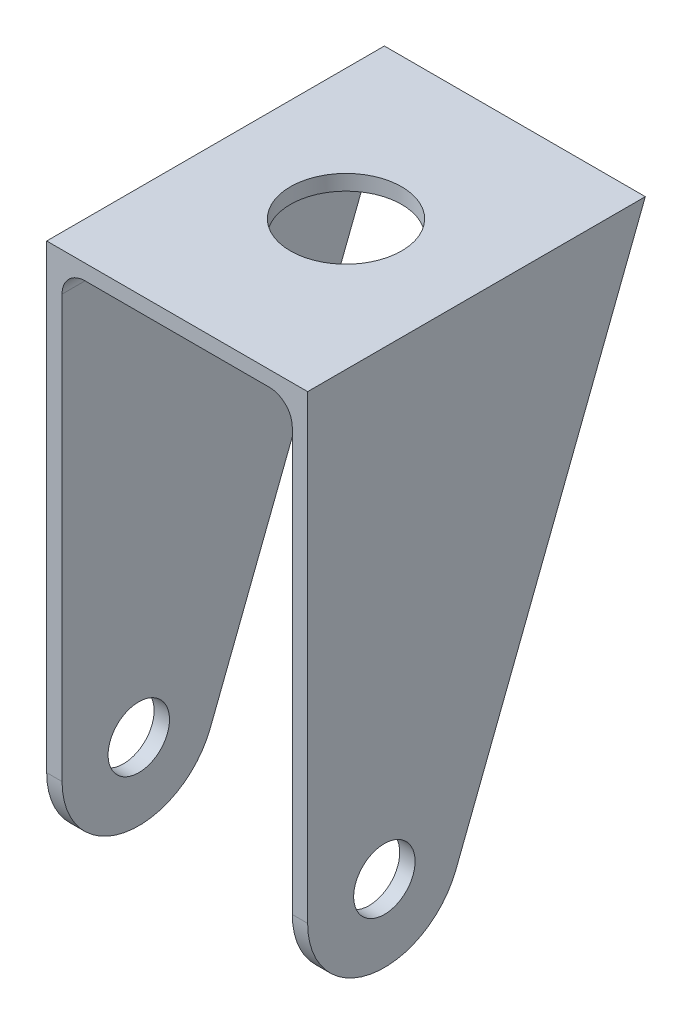
ISO-10303-21;
HEADER;
FILE_DESCRIPTION(('STEP AP214'),'2;1');
FILE_NAME('part.step','',(''),(''),'','','');
FILE_SCHEMA(('AUTOMOTIVE_DESIGN { 1 0 10303 214 1 1 1 1 }'));
ENDSEC;
DATA;
#1=APPLICATION_CONTEXT('core data for automotive mechanical design processes');
#2=APPLICATION_PROTOCOL_DEFINITION('international standard','automotive_design',2000,#1);
#3=PRODUCT_CONTEXT('',#1,'mechanical');
#4=PRODUCT('Part','Part','',(#3));
#5=PRODUCT_RELATED_PRODUCT_CATEGORY('part','',(#4));
#6=PRODUCT_DEFINITION_FORMATION('','',#4);
#7=PRODUCT_DEFINITION_CONTEXT('part definition',#1,'design');
#8=PRODUCT_DEFINITION('design','',#6,#7);
#9=PRODUCT_DEFINITION_SHAPE('','',#8);
#10=(LENGTH_UNIT() NAMED_UNIT(*) SI_UNIT(.MILLI.,.METRE.));
#11=(NAMED_UNIT(*) PLANE_ANGLE_UNIT() SI_UNIT($,.RADIAN.));
#12=(NAMED_UNIT(*) SI_UNIT($,.STERADIAN.) SOLID_ANGLE_UNIT());
#13=UNCERTAINTY_MEASURE_WITH_UNIT(LENGTH_MEASURE(1.E-05),#10,'distance_accuracy_value','');
#14=(GEOMETRIC_REPRESENTATION_CONTEXT(3) GLOBAL_UNCERTAINTY_ASSIGNED_CONTEXT((#13)) GLOBAL_UNIT_ASSIGNED_CONTEXT((#10,
#11,#12)) REPRESENTATION_CONTEXT('',''));
#15=CARTESIAN_POINT('',(0.,0.,0.));
#16=DIRECTION('',(0.,0.,1.));
#17=DIRECTION('',(1.,0.,0.));
#18=AXIS2_PLACEMENT_3D('',#15,#16,#17);
#19=CARTESIAN_POINT('',(-17.,0.,0.));
#20=DIRECTION('',(1.,0.,0.));
#21=DIRECTION('',(0.,0.,-1.));
#22=AXIS2_PLACEMENT_3D('',#19,#20,#21);
#23=CYLINDRICAL_SURFACE('',#22,9.99999999999999);
#24=DIRECTION('',(1.,0.,0.));
#25=VECTOR('',#24,1.);
#26=CARTESIAN_POINT('',(-17.,-3.61645543914119,-9.32315665730797));
#27=LINE('',#26,#25);
#28=CARTESIAN_POINT('',(-17.,-3.61645543914119,-9.32315665730797));
#29=VERTEX_POINT('',#28);
#30=CARTESIAN_POINT('',(-15.,-3.61645543914119,-9.32315665730797));
#31=VERTEX_POINT('',#30);
#32=EDGE_CURVE('E36',#29,#31,#27,.T.);
#33=ORIENTED_EDGE('',*,*,#32,.T.);
#34=CARTESIAN_POINT('',(-15.,0.,0.));
#35=DIRECTION('',(1.,0.,0.));
#36=DIRECTION('',(0.,0.,-1.));
#37=AXIS2_PLACEMENT_3D('',#34,#35,#36);
#38=CIRCLE('',#37,9.99999999999999);
#39=CARTESIAN_POINT('',(-15.,0.,10.));
#40=VERTEX_POINT('',#39);
#41=EDGE_CURVE('E117',#40,#31,#38,.T.);
#42=ORIENTED_EDGE('',*,*,#41,.F.);
#43=DIRECTION('',(1.,0.,0.));
#44=VECTOR('',#43,1.);
#45=CARTESIAN_POINT('',(-17.,0.,10.));
#46=LINE('',#45,#44);
#47=CARTESIAN_POINT('',(-17.,0.,10.));
#48=VERTEX_POINT('',#47);
#49=EDGE_CURVE('E11',#48,#40,#46,.T.);
#50=ORIENTED_EDGE('',*,*,#49,.F.);
#51=CARTESIAN_POINT('',(-17.,0.,0.));
#52=DIRECTION('',(1.,0.,0.));
#53=DIRECTION('',(0.,0.,-1.));
#54=AXIS2_PLACEMENT_3D('',#51,#52,#53);
#55=CIRCLE('',#54,9.99999999999999);
#56=EDGE_CURVE('E132',#48,#29,#55,.T.);
#57=ORIENTED_EDGE('',*,*,#56,.T.);
#58=EDGE_LOOP('',(#33,#42,#50,#57));
#59=FACE_BOUND('',#58,.T.);
#60=ADVANCED_FACE('F33',(#59),#23,.T.);
#61=CARTESIAN_POINT('',(15.,0.,10.));
#62=VERTEX_POINT('',#61);
#63=CARTESIAN_POINT('',(17.,0.,10.));
#64=VERTEX_POINT('',#63);
#65=EDGE_CURVE('E41',#62,#64,#46,.T.);
#66=ORIENTED_EDGE('',*,*,#65,.F.);
#67=CARTESIAN_POINT('',(15.,0.,0.));
#68=DIRECTION('',(-1.,0.,0.));
#69=DIRECTION('',(0.,-1.,0.));
#70=AXIS2_PLACEMENT_3D('',#67,#68,#69);
#71=CIRCLE('',#70,9.99999999999999);
#72=CARTESIAN_POINT('',(15.,-3.61645543914119,-9.32315665730797));
#73=VERTEX_POINT('',#72);
#74=EDGE_CURVE('E123',#73,#62,#71,.T.);
#75=ORIENTED_EDGE('',*,*,#74,.F.);
#76=CARTESIAN_POINT('',(17.,-3.61645543914119,-9.32315665730797));
#77=VERTEX_POINT('',#76);
#78=EDGE_CURVE('E134',#73,#77,#27,.T.);
#79=ORIENTED_EDGE('',*,*,#78,.T.);
#80=CARTESIAN_POINT('',(17.,0.,0.));
#81=DIRECTION('',(1.,0.,0.));
#82=DIRECTION('',(0.,0.,-1.));
#83=AXIS2_PLACEMENT_3D('',#80,#81,#82);
#84=CIRCLE('',#83,9.99999999999999);
#85=EDGE_CURVE('E150',#64,#77,#84,.T.);
#86=ORIENTED_EDGE('',*,*,#85,.F.);
#87=EDGE_LOOP('',(#66,#75,#79,#86));
#88=FACE_BOUND('',#87,.T.);
#89=ADVANCED_FACE('F171',(#88),#23,.T.);
#90=CARTESIAN_POINT('',(-17.,0.,10.));
#91=DIRECTION('',(0.,0.,1.));
#92=DIRECTION('',(1.,0.,0.));
#93=AXIS2_PLACEMENT_3D('',#90,#91,#92);
#94=PLANE('',#93);
#95=ORIENTED_EDGE('',*,*,#49,.T.);
#96=DIRECTION('',(0.,-1.,0.));
#97=VECTOR('',#96,1.);
#98=CARTESIAN_POINT('',(-15.,-9.99999999999999,10.));
#99=LINE('',#98,#97);
#100=CARTESIAN_POINT('',(-15.,55.,10.));
#101=VERTEX_POINT('',#100);
#102=EDGE_CURVE('E121',#101,#40,#99,.T.);
#103=ORIENTED_EDGE('',*,*,#102,.F.);
#104=CARTESIAN_POINT('',(-12.,55.,10.));
#105=DIRECTION('',(0.,0.,1.));
#106=DIRECTION('',(1.,0.,0.));
#107=AXIS2_PLACEMENT_3D('',#104,#105,#106);
#108=CIRCLE('',#107,3.);
#109=CARTESIAN_POINT('',(-12.,58.,10.));
#110=VERTEX_POINT('',#109);
#111=EDGE_CURVE('E300',#110,#101,#108,.T.);
#112=ORIENTED_EDGE('',*,*,#111,.F.);
#113=DIRECTION('',(-1.,0.,0.));
#114=VECTOR('',#113,1.);
#115=CARTESIAN_POINT('',(-12.,58.,10.));
#116=LINE('',#115,#114);
#117=CARTESIAN_POINT('',(12.,58.,10.));
#118=VERTEX_POINT('',#117);
#119=EDGE_CURVE('E122',#118,#110,#116,.T.);
#120=ORIENTED_EDGE('',*,*,#119,.F.);
#121=CARTESIAN_POINT('',(12.,55.,10.));
#122=DIRECTION('',(0.,0.,1.));
#123=DIRECTION('',(1.,0.,0.));
#124=AXIS2_PLACEMENT_3D('',#121,#122,#123);
#125=CIRCLE('',#124,3.);
#126=CARTESIAN_POINT('',(15.,55.,10.));
#127=VERTEX_POINT('',#126);
#128=EDGE_CURVE('E321',#127,#118,#125,.T.);
#129=ORIENTED_EDGE('',*,*,#128,.F.);
#130=DIRECTION('',(0.,1.,0.));
#131=VECTOR('',#130,1.);
#132=CARTESIAN_POINT('',(15.,55.,10.));
#133=LINE('',#132,#131);
#134=EDGE_CURVE('E324',#62,#127,#133,.T.);
#135=ORIENTED_EDGE('',*,*,#134,.F.);
#136=ORIENTED_EDGE('',*,*,#65,.T.);
#137=DIRECTION('',(0.,-1.,0.));
#138=VECTOR('',#137,1.);
#139=CARTESIAN_POINT('',(17.,0.,10.));
#140=LINE('',#139,#138);
#141=CARTESIAN_POINT('',(17.,60.,10.));
#142=VERTEX_POINT('',#141);
#143=EDGE_CURVE('E160',#142,#64,#140,.T.);
#144=ORIENTED_EDGE('',*,*,#143,.F.);
#145=DIRECTION('',(1.,0.,0.));
#146=VECTOR('',#145,1.);
#147=CARTESIAN_POINT('',(-17.,60.,10.));
#148=LINE('',#147,#146);
#149=CARTESIAN_POINT('',(-17.,60.,10.));
#150=VERTEX_POINT('',#149);
#151=EDGE_CURVE('E135',#150,#142,#148,.T.);
#152=ORIENTED_EDGE('',*,*,#151,.F.);
#153=DIRECTION('',(0.,-1.,0.));
#154=VECTOR('',#153,1.);
#155=CARTESIAN_POINT('',(-17.,0.,10.));
#156=LINE('',#155,#154);
#157=EDGE_CURVE('E136',#150,#48,#156,.T.);
#158=ORIENTED_EDGE('',*,*,#157,.T.);
#159=EDGE_LOOP('',(#95,#103,#112,#120,#129,#135,#136,#144,#152,#158));
#160=FACE_BOUND('',#159,.T.);
#161=ADVANCED_FACE('F169',(#160),#94,.T.);
#162=CARTESIAN_POINT('',(-17.,60.,-34.));
#163=DIRECTION('',(0.,-0.361645543914119,-0.932315665730798));
#164=DIRECTION('',(0.,0.932315665730798,-0.361645543914119));
#165=AXIS2_PLACEMENT_3D('',#162,#163,#164);
#166=PLANE('',#165);
#167=CARTESIAN_POINT('',(-12.,55.,-32.0604984062418));
#168=DIRECTION('',(0.,-0.361645543914119,-0.932315665730798));
#169=DIRECTION('',(0.,-0.932315665730798,0.361645543914119));
#170=AXIS2_PLACEMENT_3D('',#167,#168,#169);
#171=ELLIPSE('',#170,3.21779426247058,3.);
#172=CARTESIAN_POINT('',(-12.,58.,-33.2241993624967));
#173=VERTEX_POINT('',#172);
#174=CARTESIAN_POINT('',(-15.,55.,-32.0604984062418));
#175=VERTEX_POINT('',#174);
#176=EDGE_CURVE('E129',#173,#175,#171,.F.);
#177=ORIENTED_EDGE('',*,*,#176,.T.);
#178=DIRECTION('',(0.,-0.932315665730798,0.361645543914119));
#179=VECTOR('',#178,1.);
#180=CARTESIAN_POINT('',(-15.,-0.844537871888236,-10.3983843651986));
#181=LINE('',#180,#179);
#182=EDGE_CURVE('E49',#175,#31,#181,.T.);
#183=ORIENTED_EDGE('',*,*,#182,.T.);
#184=ORIENTED_EDGE('',*,*,#32,.F.);
#185=DIRECTION('',(0.,0.932315665730798,-0.361645543914119));
#186=VECTOR('',#185,1.);
#187=CARTESIAN_POINT('',(-17.,60.,-34.));
#188=LINE('',#187,#186);
#189=CARTESIAN_POINT('',(-17.,60.,-34.));
#190=VERTEX_POINT('',#189);
#191=EDGE_CURVE('E146',#29,#190,#188,.T.);
#192=ORIENTED_EDGE('',*,*,#191,.T.);
#193=DIRECTION('',(1.,0.,0.));
#194=VECTOR('',#193,1.);
#195=CARTESIAN_POINT('',(-17.,60.,-34.));
#196=LINE('',#195,#194);
#197=CARTESIAN_POINT('',(17.,60.,-34.));
#198=VERTEX_POINT('',#197);
#199=EDGE_CURVE('E133',#190,#198,#196,.T.);
#200=ORIENTED_EDGE('',*,*,#199,.T.);
#201=DIRECTION('',(0.,0.932315665730798,-0.361645543914119));
#202=VECTOR('',#201,1.);
#203=CARTESIAN_POINT('',(17.,60.,-34.));
#204=LINE('',#203,#202);
#205=EDGE_CURVE('E153',#77,#198,#204,.T.);
#206=ORIENTED_EDGE('',*,*,#205,.F.);
#207=ORIENTED_EDGE('',*,*,#78,.F.);
#208=DIRECTION('',(0.,0.932315665730798,-0.361645543914119));
#209=VECTOR('',#208,1.);
#210=CARTESIAN_POINT('',(15.,55.6542746649707,-32.3142917573351));
#211=LINE('',#210,#209);
#212=CARTESIAN_POINT('',(15.,55.,-32.0604984062418));
#213=VERTEX_POINT('',#212);
#214=EDGE_CURVE('E130',#73,#213,#211,.T.);
#215=ORIENTED_EDGE('',*,*,#214,.T.);
#216=CARTESIAN_POINT('',(12.,55.,-32.0604984062418));
#217=DIRECTION('',(0.,-0.361645543914119,-0.932315665730798));
#218=DIRECTION('',(0.,-0.932315665730798,0.361645543914119));
#219=AXIS2_PLACEMENT_3D('',#216,#217,#218);
#220=ELLIPSE('',#219,3.21779426247058,3.);
#221=CARTESIAN_POINT('',(12.,58.,-33.2241993624967));
#222=VERTEX_POINT('',#221);
#223=EDGE_CURVE('E336',#213,#222,#220,.F.);
#224=ORIENTED_EDGE('',*,*,#223,.T.);
#225=DIRECTION('',(-1.,0.,0.));
#226=VECTOR('',#225,1.);
#227=CARTESIAN_POINT('',(-12.,58.,-33.2241993624967));
#228=LINE('',#227,#226);
#229=EDGE_CURVE('E338',#222,#173,#228,.T.);
#230=ORIENTED_EDGE('',*,*,#229,.T.);
#231=EDGE_LOOP('',(#177,#183,#184,#192,#200,#206,#207,#215,#224,#230));
#232=FACE_BOUND('',#231,.T.);
#233=ADVANCED_FACE('F126',(#232),#166,.T.);
#234=CARTESIAN_POINT('',(-17.,0.,0.));
#235=DIRECTION('',(1.,0.,0.));
#236=DIRECTION('',(0.,0.,-1.));
#237=AXIS2_PLACEMENT_3D('',#234,#235,#236);
#238=CYLINDRICAL_SURFACE('',#237,4.);
#239=CARTESIAN_POINT('',(-17.,0.,0.));
#240=DIRECTION('',(1.,0.,0.));
#241=DIRECTION('',(0.,0.,-1.));
#242=AXIS2_PLACEMENT_3D('',#239,#240,#241);
#243=CIRCLE('',#242,4.);
#244=CARTESIAN_POINT('',(-17.,0.,-4.));
#245=VERTEX_POINT('',#244);
#246=EDGE_CURVE('E154',#245,#245,#243,.T.);
#247=ORIENTED_EDGE('',*,*,#246,.F.);
#248=EDGE_LOOP('',(#247));
#249=FACE_BOUND('',#248,.T.);
#250=CARTESIAN_POINT('',(-15.,0.,0.));
#251=DIRECTION('',(1.,0.,0.));
#252=DIRECTION('',(0.,0.,-1.));
#253=AXIS2_PLACEMENT_3D('',#250,#251,#252);
#254=CIRCLE('',#253,4.);
#255=CARTESIAN_POINT('',(-15.,0.,-4.));
#256=VERTEX_POINT('',#255);
#257=EDGE_CURVE('E312',#256,#256,#254,.T.);
#258=ORIENTED_EDGE('',*,*,#257,.T.);
#259=EDGE_LOOP('',(#258));
#260=FACE_BOUND('',#259,.T.);
#261=ADVANCED_FACE('F177',(#249,#260),#238,.F.);
#262=CARTESIAN_POINT('',(17.,0.,0.));
#263=DIRECTION('',(1.,0.,0.));
#264=DIRECTION('',(0.,0.,-1.));
#265=AXIS2_PLACEMENT_3D('',#262,#263,#264);
#266=CIRCLE('',#265,4.);
#267=CARTESIAN_POINT('',(17.,0.,-4.));
#268=VERTEX_POINT('',#267);
#269=EDGE_CURVE('E299',#268,#268,#266,.T.);
#270=ORIENTED_EDGE('',*,*,#269,.T.);
#271=EDGE_LOOP('',(#270));
#272=FACE_BOUND('',#271,.T.);
#273=CARTESIAN_POINT('',(15.,0.,0.));
#274=DIRECTION('',(-1.,0.,0.));
#275=DIRECTION('',(0.,-1.,0.));
#276=AXIS2_PLACEMENT_3D('',#273,#274,#275);
#277=CIRCLE('',#276,4.);
#278=CARTESIAN_POINT('',(15.,-4.,0.));
#279=VERTEX_POINT('',#278);
#280=EDGE_CURVE('E315',#279,#279,#277,.T.);
#281=ORIENTED_EDGE('',*,*,#280,.T.);
#282=EDGE_LOOP('',(#281));
#283=FACE_BOUND('',#282,.T.);
#284=ADVANCED_FACE('F207',(#272,#283),#238,.F.);
#285=CARTESIAN_POINT('',(-17.,60.,10.));
#286=DIRECTION('',(0.,1.,0.));
#287=DIRECTION('',(0.,0.,1.));
#288=AXIS2_PLACEMENT_3D('',#285,#286,#287);
#289=PLANE('',#288);
#290=CARTESIAN_POINT('',(0.,60.,-12.));
#291=DIRECTION('',(0.,1.,0.));
#292=DIRECTION('',(0.,0.,1.));
#293=AXIS2_PLACEMENT_3D('',#290,#291,#292);
#294=CIRCLE('',#293,7.25);
#295=CARTESIAN_POINT('',(0.,60.,-4.75));
#296=VERTEX_POINT('',#295);
#297=EDGE_CURVE('E339',#296,#296,#294,.T.);
#298=ORIENTED_EDGE('',*,*,#297,.F.);
#299=EDGE_LOOP('',(#298));
#300=FACE_BOUND('',#299,.T.);
#301=DIRECTION('',(0.,0.,1.));
#302=VECTOR('',#301,1.);
#303=CARTESIAN_POINT('',(17.,60.,10.));
#304=LINE('',#303,#302);
#305=EDGE_CURVE('E157',#198,#142,#304,.T.);
#306=ORIENTED_EDGE('',*,*,#305,.F.);
#307=ORIENTED_EDGE('',*,*,#199,.F.);
#308=DIRECTION('',(0.,0.,1.));
#309=VECTOR('',#308,1.);
#310=CARTESIAN_POINT('',(-17.,60.,10.));
#311=LINE('',#310,#309);
#312=EDGE_CURVE('E142',#190,#150,#311,.T.);
#313=ORIENTED_EDGE('',*,*,#312,.T.);
#314=ORIENTED_EDGE('',*,*,#151,.T.);
#315=EDGE_LOOP('',(#306,#307,#313,#314));
#316=FACE_BOUND('',#315,.T.);
#317=ADVANCED_FACE('F165',(#300,#316),#289,.T.);
#318=CARTESIAN_POINT('',(-17.,0.,0.));
#319=DIRECTION('',(1.,0.,0.));
#320=DIRECTION('',(0.,0.,-1.));
#321=AXIS2_PLACEMENT_3D('',#318,#319,#320);
#322=PLANE('',#321);
#323=ORIENTED_EDGE('',*,*,#246,.T.);
#324=EDGE_LOOP('',(#323));
#325=FACE_BOUND('',#324,.T.);
#326=ORIENTED_EDGE('',*,*,#56,.F.);
#327=ORIENTED_EDGE('',*,*,#157,.F.);
#328=ORIENTED_EDGE('',*,*,#312,.F.);
#329=ORIENTED_EDGE('',*,*,#191,.F.);
#330=EDGE_LOOP('',(#326,#327,#328,#329));
#331=FACE_BOUND('',#330,.T.);
#332=ADVANCED_FACE('F271',(#325,#331),#322,.F.);
#333=CARTESIAN_POINT('',(17.,0.,0.));
#334=DIRECTION('',(1.,0.,0.));
#335=DIRECTION('',(0.,0.,-1.));
#336=AXIS2_PLACEMENT_3D('',#333,#334,#335);
#337=PLANE('',#336);
#338=ORIENTED_EDGE('',*,*,#269,.F.);
#339=EDGE_LOOP('',(#338));
#340=FACE_BOUND('',#339,.T.);
#341=ORIENTED_EDGE('',*,*,#85,.T.);
#342=ORIENTED_EDGE('',*,*,#205,.T.);
#343=ORIENTED_EDGE('',*,*,#305,.T.);
#344=ORIENTED_EDGE('',*,*,#143,.T.);
#345=EDGE_LOOP('',(#341,#342,#343,#344));
#346=FACE_BOUND('',#345,.T.);
#347=ADVANCED_FACE('F168',(#340,#346),#337,.T.);
#348=CARTESIAN_POINT('',(-15.,-9.99999999999999,10.001));
#349=DIRECTION('',(1.,0.,0.));
#350=DIRECTION('',(0.,0.,-1.));
#351=AXIS2_PLACEMENT_3D('',#348,#349,#350);
#352=PLANE('',#351);
#353=ORIENTED_EDGE('',*,*,#182,.F.);
#354=DIRECTION('',(0.,0.,-1.));
#355=VECTOR('',#354,1.);
#356=CARTESIAN_POINT('',(-15.,55.,10.001));
#357=LINE('',#356,#355);
#358=EDGE_CURVE('E327',#101,#175,#357,.T.);
#359=ORIENTED_EDGE('',*,*,#358,.F.);
#360=ORIENTED_EDGE('',*,*,#102,.T.);
#361=ORIENTED_EDGE('',*,*,#41,.T.);
#362=EDGE_LOOP('',(#353,#359,#360,#361));
#363=FACE_BOUND('',#362,.T.);
#364=ORIENTED_EDGE('',*,*,#257,.F.);
#365=EDGE_LOOP('',(#364));
#366=FACE_BOUND('',#365,.T.);
#367=ADVANCED_FACE('F118',(#363,#366),#352,.T.);
#368=CARTESIAN_POINT('',(15.,55.,10.001));
#369=DIRECTION('',(-1.,0.,0.));
#370=DIRECTION('',(0.,-1.,0.));
#371=AXIS2_PLACEMENT_3D('',#368,#369,#370);
#372=PLANE('',#371);
#373=ORIENTED_EDGE('',*,*,#280,.F.);
#374=EDGE_LOOP('',(#373));
#375=FACE_BOUND('',#374,.T.);
#376=ORIENTED_EDGE('',*,*,#74,.T.);
#377=ORIENTED_EDGE('',*,*,#134,.T.);
#378=DIRECTION('',(0.,0.,-1.));
#379=VECTOR('',#378,1.);
#380=CARTESIAN_POINT('',(15.,55.,10.001));
#381=LINE('',#380,#379);
#382=EDGE_CURVE('E305',#127,#213,#381,.T.);
#383=ORIENTED_EDGE('',*,*,#382,.T.);
#384=ORIENTED_EDGE('',*,*,#214,.F.);
#385=EDGE_LOOP('',(#376,#377,#383,#384));
#386=FACE_BOUND('',#385,.T.);
#387=ADVANCED_FACE('F227',(#375,#386),#372,.T.);
#388=CARTESIAN_POINT('',(12.,55.,10.001));
#389=DIRECTION('',(0.,0.,-1.));
#390=DIRECTION('',(-1.,0.,0.));
#391=AXIS2_PLACEMENT_3D('',#388,#389,#390);
#392=CYLINDRICAL_SURFACE('',#391,3.);
#393=ORIENTED_EDGE('',*,*,#128,.T.);
#394=DIRECTION('',(0.,0.,-1.));
#395=VECTOR('',#394,1.);
#396=CARTESIAN_POINT('',(12.,58.,10.001));
#397=LINE('',#396,#395);
#398=EDGE_CURVE('E331',#118,#222,#397,.T.);
#399=ORIENTED_EDGE('',*,*,#398,.T.);
#400=ORIENTED_EDGE('',*,*,#223,.F.);
#401=ORIENTED_EDGE('',*,*,#382,.F.);
#402=EDGE_LOOP('',(#393,#399,#400,#401));
#403=FACE_BOUND('',#402,.T.);
#404=ADVANCED_FACE('F237',(#403),#392,.F.);
#405=CARTESIAN_POINT('',(-12.,58.,10.001));
#406=DIRECTION('',(0.,-1.,0.));
#407=DIRECTION('',(1.,0.,0.));
#408=AXIS2_PLACEMENT_3D('',#405,#406,#407);
#409=PLANE('',#408);
#410=CARTESIAN_POINT('',(0.,58.,-12.));
#411=DIRECTION('',(0.,-1.,0.));
#412=DIRECTION('',(1.,0.,0.));
#413=AXIS2_PLACEMENT_3D('',#410,#411,#412);
#414=CIRCLE('',#413,7.25);
#415=CARTESIAN_POINT('',(7.25,58.,-12.));
#416=VERTEX_POINT('',#415);
#417=EDGE_CURVE('E346',#416,#416,#414,.F.);
#418=ORIENTED_EDGE('',*,*,#417,.T.);
#419=EDGE_LOOP('',(#418));
#420=FACE_BOUND('',#419,.T.);
#421=ORIENTED_EDGE('',*,*,#119,.T.);
#422=DIRECTION('',(0.,0.,-1.));
#423=VECTOR('',#422,1.);
#424=CARTESIAN_POINT('',(-12.,58.,10.001));
#425=LINE('',#424,#423);
#426=EDGE_CURVE('E329',#110,#173,#425,.T.);
#427=ORIENTED_EDGE('',*,*,#426,.T.);
#428=ORIENTED_EDGE('',*,*,#229,.F.);
#429=ORIENTED_EDGE('',*,*,#398,.F.);
#430=EDGE_LOOP('',(#421,#427,#428,#429));
#431=FACE_BOUND('',#430,.T.);
#432=ADVANCED_FACE('F247',(#420,#431),#409,.T.);
#433=CARTESIAN_POINT('',(-12.,55.,10.001));
#434=DIRECTION('',(0.,0.,-1.));
#435=DIRECTION('',(-1.,0.,0.));
#436=AXIS2_PLACEMENT_3D('',#433,#434,#435);
#437=CYLINDRICAL_SURFACE('',#436,3.);
#438=ORIENTED_EDGE('',*,*,#111,.T.);
#439=ORIENTED_EDGE('',*,*,#358,.T.);
#440=ORIENTED_EDGE('',*,*,#176,.F.);
#441=ORIENTED_EDGE('',*,*,#426,.F.);
#442=EDGE_LOOP('',(#438,#439,#440,#441));
#443=FACE_BOUND('',#442,.T.);
#444=ADVANCED_FACE('F255',(#443),#437,.F.);
#445=CARTESIAN_POINT('',(0.,-10.001,-12.));
#446=DIRECTION('',(0.,1.,0.));
#447=DIRECTION('',(0.,0.,1.));
#448=AXIS2_PLACEMENT_3D('',#445,#446,#447);
#449=CYLINDRICAL_SURFACE('',#448,7.25);
#450=ORIENTED_EDGE('',*,*,#417,.F.);
#451=EDGE_LOOP('',(#450));
#452=FACE_BOUND('',#451,.T.);
#453=ORIENTED_EDGE('',*,*,#297,.T.);
#454=EDGE_LOOP('',(#453));
#455=FACE_BOUND('',#454,.T.);
#456=ADVANCED_FACE('F260',(#452,#455),#449,.F.);
#457=CLOSED_SHELL('',(#60,#89,#161,#233,#261,#284,#317,#332,#347,#367,#387,#404,#432,#444,#456));
#458=MANIFOLD_SOLID_BREP('B2',#457);
#459=ADVANCED_BREP_SHAPE_REPRESENTATION('',(#18,#458),#14);
#460=SHAPE_DEFINITION_REPRESENTATION(#9,#459);
ENDSEC;
END-ISO-10303-21;
